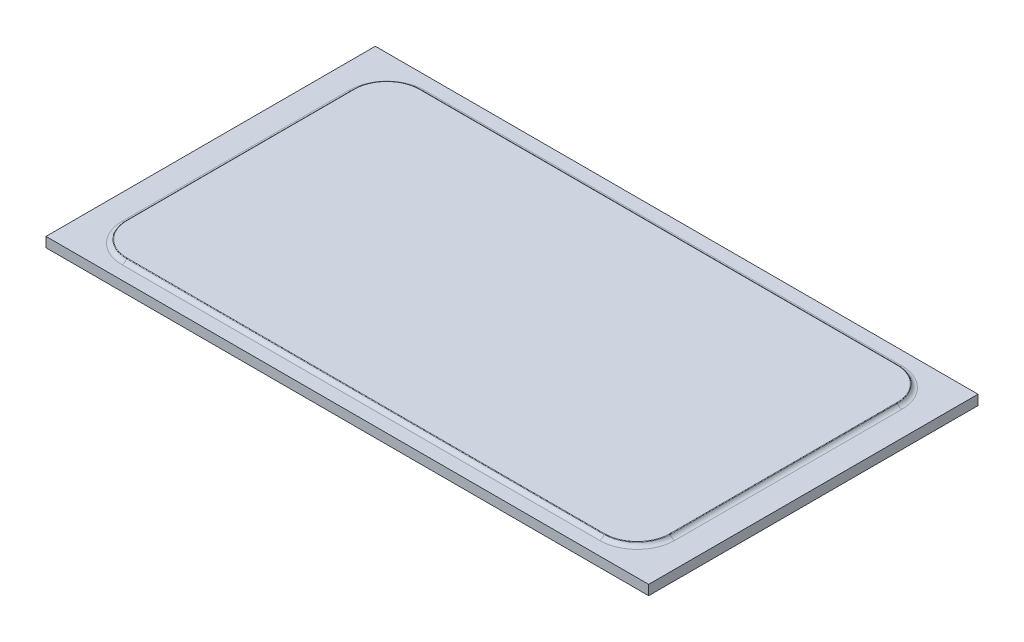
ISO-10303-21;
HEADER;
FILE_DESCRIPTION(('STEP AP214'),'2;1');
FILE_NAME('part.step','',(''),(''),'','','');
FILE_SCHEMA(('AUTOMOTIVE_DESIGN { 1 0 10303 214 1 1 1 1 }'));
ENDSEC;
DATA;
#1=APPLICATION_CONTEXT('core data for automotive mechanical design processes');
#2=APPLICATION_PROTOCOL_DEFINITION('international standard','automotive_design',2000,#1);
#3=PRODUCT_CONTEXT('',#1,'mechanical');
#4=PRODUCT('Part','Part','',(#3));
#5=PRODUCT_RELATED_PRODUCT_CATEGORY('part','',(#4));
#6=PRODUCT_DEFINITION_FORMATION('','',#4);
#7=PRODUCT_DEFINITION_CONTEXT('part definition',#1,'design');
#8=PRODUCT_DEFINITION('design','',#6,#7);
#9=PRODUCT_DEFINITION_SHAPE('','',#8);
#10=(LENGTH_UNIT() NAMED_UNIT(*) SI_UNIT(.MILLI.,.METRE.));
#11=(NAMED_UNIT(*) PLANE_ANGLE_UNIT() SI_UNIT($,.RADIAN.));
#12=(NAMED_UNIT(*) SI_UNIT($,.STERADIAN.) SOLID_ANGLE_UNIT());
#13=UNCERTAINTY_MEASURE_WITH_UNIT(LENGTH_MEASURE(1.E-05),#10,'distance_accuracy_value','');
#14=(GEOMETRIC_REPRESENTATION_CONTEXT(3) GLOBAL_UNCERTAINTY_ASSIGNED_CONTEXT((#13)) GLOBAL_UNIT_ASSIGNED_CONTEXT((#10,
#11,#12)) REPRESENTATION_CONTEXT('',''));
#15=CARTESIAN_POINT('',(0.,0.,0.));
#16=DIRECTION('',(0.,0.,1.));
#17=DIRECTION('',(1.,0.,0.));
#18=AXIS2_PLACEMENT_3D('',#15,#16,#17);
#19=CARTESIAN_POINT('',(0.,3.,0.));
#20=DIRECTION('',(0.,-1.,0.));
#21=DIRECTION('',(0.,0.,-1.));
#22=AXIS2_PLACEMENT_3D('',#19,#20,#21);
#23=PLANE('',#22);
#24=DIRECTION('',(-1.,0.,0.));
#25=VECTOR('',#24,1.);
#26=CARTESIAN_POINT('',(0.,3.,45.9142135623731));
#27=LINE('',#26,#25);
#28=CARTESIAN_POINT('',(72.5,3.,45.9142135623731));
#29=VERTEX_POINT('',#28);
#30=CARTESIAN_POINT('',(-72.5,3.,45.9142135623731));
#31=VERTEX_POINT('',#30);
#32=EDGE_CURVE('E178',#29,#31,#27,.T.);
#33=ORIENTED_EDGE('',*,*,#32,.T.);
#34=CARTESIAN_POINT('',(-72.5,3.,34.5));
#35=DIRECTION('',(0.,-1.,0.));
#36=DIRECTION('',(0.,0.,-1.));
#37=AXIS2_PLACEMENT_3D('',#34,#35,#36);
#38=CIRCLE('',#37,11.4142135623731);
#39=CARTESIAN_POINT('',(-83.9142135623731,3.,34.5));
#40=VERTEX_POINT('',#39);
#41=EDGE_CURVE('E200',#31,#40,#38,.T.);
#42=ORIENTED_EDGE('',*,*,#41,.T.);
#43=DIRECTION('',(0.,0.,-1.));
#44=VECTOR('',#43,1.);
#45=CARTESIAN_POINT('',(-83.9142135623731,3.,0.));
#46=LINE('',#45,#44);
#47=CARTESIAN_POINT('',(-83.9142135623731,3.,-34.5));
#48=VERTEX_POINT('',#47);
#49=EDGE_CURVE('E197',#40,#48,#46,.T.);
#50=ORIENTED_EDGE('',*,*,#49,.T.);
#51=CARTESIAN_POINT('',(-72.5,3.,-34.5));
#52=DIRECTION('',(0.,-1.,0.));
#53=DIRECTION('',(0.,0.,-1.));
#54=AXIS2_PLACEMENT_3D('',#51,#52,#53);
#55=CIRCLE('',#54,11.4142135623731);
#56=CARTESIAN_POINT('',(-72.5,3.,-45.9142135623731));
#57=VERTEX_POINT('',#56);
#58=EDGE_CURVE('E194',#48,#57,#55,.T.);
#59=ORIENTED_EDGE('',*,*,#58,.T.);
#60=DIRECTION('',(1.,0.,0.));
#61=VECTOR('',#60,1.);
#62=CARTESIAN_POINT('',(0.,3.,-45.9142135623731));
#63=LINE('',#62,#61);
#64=CARTESIAN_POINT('',(72.5,3.,-45.9142135623731));
#65=VERTEX_POINT('',#64);
#66=EDGE_CURVE('E191',#57,#65,#63,.T.);
#67=ORIENTED_EDGE('',*,*,#66,.T.);
#68=CARTESIAN_POINT('',(72.5,3.,-34.5));
#69=DIRECTION('',(0.,-1.,0.));
#70=DIRECTION('',(0.,0.,-1.));
#71=AXIS2_PLACEMENT_3D('',#68,#69,#70);
#72=CIRCLE('',#71,11.4142135623731);
#73=CARTESIAN_POINT('',(83.9142135623731,3.,-34.5));
#74=VERTEX_POINT('',#73);
#75=EDGE_CURVE('E189',#65,#74,#72,.T.);
#76=ORIENTED_EDGE('',*,*,#75,.T.);
#77=DIRECTION('',(0.,0.,1.));
#78=VECTOR('',#77,1.);
#79=CARTESIAN_POINT('',(83.9142135623731,3.,0.));
#80=LINE('',#79,#78);
#81=CARTESIAN_POINT('',(83.9142135623731,3.,34.5));
#82=VERTEX_POINT('',#81);
#83=EDGE_CURVE('E187',#74,#82,#80,.T.);
#84=ORIENTED_EDGE('',*,*,#83,.T.);
#85=CARTESIAN_POINT('',(72.5,3.,34.5));
#86=DIRECTION('',(0.,-1.,0.));
#87=DIRECTION('',(0.,0.,-1.));
#88=AXIS2_PLACEMENT_3D('',#85,#86,#87);
#89=CIRCLE('',#88,11.4142135623731);
#90=EDGE_CURVE('E180',#82,#29,#89,.T.);
#91=ORIENTED_EDGE('',*,*,#90,.T.);
#92=EDGE_LOOP('',(#33,#42,#50,#59,#67,#76,#84,#91));
#93=FACE_BOUND('',#92,.T.);
#94=DIRECTION('',(0.,0.,1.));
#95=VECTOR('',#94,1.);
#96=CARTESIAN_POINT('',(-91.5,3.,-50.));
#97=LINE('',#96,#95);
#98=CARTESIAN_POINT('',(-91.5,3.,-50.));
#99=VERTEX_POINT('',#98);
#100=CARTESIAN_POINT('',(-91.5,3.,50.));
#101=VERTEX_POINT('',#100);
#102=EDGE_CURVE('E165',#99,#101,#97,.T.);
#103=ORIENTED_EDGE('',*,*,#102,.T.);
#104=DIRECTION('',(1.,0.,0.));
#105=VECTOR('',#104,1.);
#106=CARTESIAN_POINT('',(91.5,3.,50.));
#107=LINE('',#106,#105);
#108=CARTESIAN_POINT('',(91.5,3.,50.));
#109=VERTEX_POINT('',#108);
#110=EDGE_CURVE('E154',#101,#109,#107,.T.);
#111=ORIENTED_EDGE('',*,*,#110,.T.);
#112=DIRECTION('',(0.,0.,-1.));
#113=VECTOR('',#112,1.);
#114=CARTESIAN_POINT('',(91.5,3.,-50.));
#115=LINE('',#114,#113);
#116=CARTESIAN_POINT('',(91.5,3.,-50.));
#117=VERTEX_POINT('',#116);
#118=EDGE_CURVE('E164',#109,#117,#115,.T.);
#119=ORIENTED_EDGE('',*,*,#118,.T.);
#120=DIRECTION('',(-1.,0.,0.));
#121=VECTOR('',#120,1.);
#122=CARTESIAN_POINT('',(91.5,3.,-50.));
#123=LINE('',#122,#121);
#124=EDGE_CURVE('E169',#117,#99,#123,.T.);
#125=ORIENTED_EDGE('',*,*,#124,.T.);
#126=EDGE_LOOP('',(#103,#111,#119,#125));
#127=FACE_BOUND('',#126,.T.);
#128=ADVANCED_FACE('F38',(#93,#127),#23,.F.);
#129=CARTESIAN_POINT('',(-91.5,3.,-50.));
#130=DIRECTION('',(1.,0.,0.));
#131=DIRECTION('',(0.,0.,-1.));
#132=AXIS2_PLACEMENT_3D('',#129,#130,#131);
#133=PLANE('',#132);
#134=DIRECTION('',(0.,0.,1.));
#135=VECTOR('',#134,1.);
#136=CARTESIAN_POINT('',(-91.5,0.,-50.));
#137=LINE('',#136,#135);
#138=CARTESIAN_POINT('',(-91.5,0.,-50.));
#139=VERTEX_POINT('',#138);
#140=CARTESIAN_POINT('',(-91.5,0.,50.));
#141=VERTEX_POINT('',#140);
#142=EDGE_CURVE('E177',#139,#141,#137,.T.);
#143=ORIENTED_EDGE('',*,*,#142,.T.);
#144=DIRECTION('',(0.,-1.,0.));
#145=VECTOR('',#144,1.);
#146=CARTESIAN_POINT('',(-91.5,3.,50.));
#147=LINE('',#146,#145);
#148=EDGE_CURVE('E158',#101,#141,#147,.T.);
#149=ORIENTED_EDGE('',*,*,#148,.F.);
#150=ORIENTED_EDGE('',*,*,#102,.F.);
#151=DIRECTION('',(0.,-1.,0.));
#152=VECTOR('',#151,1.);
#153=CARTESIAN_POINT('',(-91.5,3.,-50.));
#154=LINE('',#153,#152);
#155=EDGE_CURVE('E577',#99,#139,#154,.T.);
#156=ORIENTED_EDGE('',*,*,#155,.T.);
#157=EDGE_LOOP('',(#143,#149,#150,#156));
#158=FACE_BOUND('',#157,.T.);
#159=ADVANCED_FACE('F175',(#158),#133,.F.);
#160=CARTESIAN_POINT('',(91.5,3.,50.));
#161=DIRECTION('',(0.,0.,-1.));
#162=DIRECTION('',(-1.,0.,0.));
#163=AXIS2_PLACEMENT_3D('',#160,#161,#162);
#164=PLANE('',#163);
#165=DIRECTION('',(1.,0.,0.));
#166=VECTOR('',#165,1.);
#167=CARTESIAN_POINT('',(91.5,0.,50.));
#168=LINE('',#167,#166);
#169=CARTESIAN_POINT('',(91.5,0.,50.));
#170=VERTEX_POINT('',#169);
#171=EDGE_CURVE('E575',#141,#170,#168,.T.);
#172=ORIENTED_EDGE('',*,*,#171,.T.);
#173=DIRECTION('',(0.,-1.,0.));
#174=VECTOR('',#173,1.);
#175=CARTESIAN_POINT('',(91.5,3.,50.));
#176=LINE('',#175,#174);
#177=EDGE_CURVE('E161',#109,#170,#176,.T.);
#178=ORIENTED_EDGE('',*,*,#177,.F.);
#179=ORIENTED_EDGE('',*,*,#110,.F.);
#180=ORIENTED_EDGE('',*,*,#148,.T.);
#181=EDGE_LOOP('',(#172,#178,#179,#180));
#182=FACE_BOUND('',#181,.T.);
#183=ADVANCED_FACE('F156',(#182),#164,.F.);
#184=CARTESIAN_POINT('',(91.5,3.,-50.));
#185=DIRECTION('',(-1.,0.,0.));
#186=DIRECTION('',(0.,0.,1.));
#187=AXIS2_PLACEMENT_3D('',#184,#185,#186);
#188=PLANE('',#187);
#189=DIRECTION('',(0.,0.,-1.));
#190=VECTOR('',#189,1.);
#191=CARTESIAN_POINT('',(91.5,0.,-50.));
#192=LINE('',#191,#190);
#193=CARTESIAN_POINT('',(91.5,0.,-50.));
#194=VERTEX_POINT('',#193);
#195=EDGE_CURVE('E572',#170,#194,#192,.T.);
#196=ORIENTED_EDGE('',*,*,#195,.T.);
#197=DIRECTION('',(0.,-1.,0.));
#198=VECTOR('',#197,1.);
#199=CARTESIAN_POINT('',(91.5,3.,-50.));
#200=LINE('',#199,#198);
#201=EDGE_CURVE('E182',#117,#194,#200,.T.);
#202=ORIENTED_EDGE('',*,*,#201,.F.);
#203=ORIENTED_EDGE('',*,*,#118,.F.);
#204=ORIENTED_EDGE('',*,*,#177,.T.);
#205=EDGE_LOOP('',(#196,#202,#203,#204));
#206=FACE_BOUND('',#205,.T.);
#207=ADVANCED_FACE('F354',(#206),#188,.F.);
#208=CARTESIAN_POINT('',(91.5,3.,-50.));
#209=DIRECTION('',(0.,0.,1.));
#210=DIRECTION('',(1.,0.,0.));
#211=AXIS2_PLACEMENT_3D('',#208,#209,#210);
#212=PLANE('',#211);
#213=DIRECTION('',(-1.,0.,0.));
#214=VECTOR('',#213,1.);
#215=CARTESIAN_POINT('',(91.5,0.,-50.));
#216=LINE('',#215,#214);
#217=EDGE_CURVE('E173',#194,#139,#216,.T.);
#218=ORIENTED_EDGE('',*,*,#217,.T.);
#219=ORIENTED_EDGE('',*,*,#155,.F.);
#220=ORIENTED_EDGE('',*,*,#124,.F.);
#221=ORIENTED_EDGE('',*,*,#201,.T.);
#222=EDGE_LOOP('',(#218,#219,#220,#221));
#223=FACE_BOUND('',#222,.T.);
#224=ADVANCED_FACE('F350',(#223),#212,.F.);
#225=CARTESIAN_POINT('',(0.,0.,0.));
#226=DIRECTION('',(0.,-1.,0.));
#227=DIRECTION('',(0.,0.,-1.));
#228=AXIS2_PLACEMENT_3D('',#225,#226,#227);
#229=PLANE('',#228);
#230=ORIENTED_EDGE('',*,*,#142,.F.);
#231=ORIENTED_EDGE('',*,*,#217,.F.);
#232=ORIENTED_EDGE('',*,*,#195,.F.);
#233=ORIENTED_EDGE('',*,*,#171,.F.);
#234=EDGE_LOOP('',(#230,#231,#232,#233));
#235=FACE_BOUND('',#234,.T.);
#236=ADVANCED_FACE('F347',(#235),#229,.T.);
#237=CARTESIAN_POINT('',(0.,4.,0.));
#238=DIRECTION('',(0.,-1.,0.));
#239=DIRECTION('',(0.,0.,-1.));
#240=AXIS2_PLACEMENT_3D('',#237,#238,#239);
#241=PLANE('',#240);
#242=DIRECTION('',(0.,0.,-1.));
#243=VECTOR('',#242,1.);
#244=CARTESIAN_POINT('',(-82.3650202238901,4.,0.));
#245=LINE('',#244,#243);
#246=CARTESIAN_POINT('',(-82.3650202238901,4.,-34.5));
#247=VERTEX_POINT('',#246);
#248=CARTESIAN_POINT('',(-82.3650202238901,4.,34.5));
#249=VERTEX_POINT('',#248);
#250=EDGE_CURVE('E232',#247,#249,#245,.F.);
#251=ORIENTED_EDGE('',*,*,#250,.T.);
#252=CARTESIAN_POINT('',(-72.5,4.,34.5));
#253=DIRECTION('',(0.,-1.,0.));
#254=DIRECTION('',(0.,0.,-1.));
#255=AXIS2_PLACEMENT_3D('',#252,#253,#254);
#256=CIRCLE('',#255,9.86502022389013);
#257=CARTESIAN_POINT('',(-72.5,4.,44.3650202238901));
#258=VERTEX_POINT('',#257);
#259=EDGE_CURVE('E234',#249,#258,#256,.F.);
#260=ORIENTED_EDGE('',*,*,#259,.T.);
#261=DIRECTION('',(-1.,0.,0.));
#262=VECTOR('',#261,1.);
#263=CARTESIAN_POINT('',(0.,4.,44.3650202238901));
#264=LINE('',#263,#262);
#265=CARTESIAN_POINT('',(72.5,4.,44.3650202238901));
#266=VERTEX_POINT('',#265);
#267=EDGE_CURVE('E203',#258,#266,#264,.F.);
#268=ORIENTED_EDGE('',*,*,#267,.T.);
#269=CARTESIAN_POINT('',(72.5,4.,34.5));
#270=DIRECTION('',(0.,-1.,0.));
#271=DIRECTION('',(0.,0.,-1.));
#272=AXIS2_PLACEMENT_3D('',#269,#270,#271);
#273=CIRCLE('',#272,9.86502022389013);
#274=CARTESIAN_POINT('',(82.3650202238901,4.,34.5));
#275=VERTEX_POINT('',#274);
#276=EDGE_CURVE('E222',#266,#275,#273,.F.);
#277=ORIENTED_EDGE('',*,*,#276,.T.);
#278=DIRECTION('',(0.,0.,1.));
#279=VECTOR('',#278,1.);
#280=CARTESIAN_POINT('',(82.3650202238901,4.,0.));
#281=LINE('',#280,#279);
#282=CARTESIAN_POINT('',(82.3650202238901,4.,-34.5));
#283=VERTEX_POINT('',#282);
#284=EDGE_CURVE('E224',#275,#283,#281,.F.);
#285=ORIENTED_EDGE('',*,*,#284,.T.);
#286=CARTESIAN_POINT('',(72.5,4.,-34.5));
#287=DIRECTION('',(0.,-1.,0.));
#288=DIRECTION('',(0.,0.,-1.));
#289=AXIS2_PLACEMENT_3D('',#286,#287,#288);
#290=CIRCLE('',#289,9.86502022389013);
#291=CARTESIAN_POINT('',(72.5,4.,-44.3650202238902));
#292=VERTEX_POINT('',#291);
#293=EDGE_CURVE('E226',#283,#292,#290,.F.);
#294=ORIENTED_EDGE('',*,*,#293,.T.);
#295=DIRECTION('',(1.,0.,0.));
#296=VECTOR('',#295,1.);
#297=CARTESIAN_POINT('',(0.,4.,-44.3650202238901));
#298=LINE('',#297,#296);
#299=CARTESIAN_POINT('',(-72.5,4.,-44.3650202238901));
#300=VERTEX_POINT('',#299);
#301=EDGE_CURVE('E228',#292,#300,#298,.F.);
#302=ORIENTED_EDGE('',*,*,#301,.T.);
#303=CARTESIAN_POINT('',(-72.5,4.,-34.5));
#304=DIRECTION('',(0.,-1.,0.));
#305=DIRECTION('',(0.,0.,-1.));
#306=AXIS2_PLACEMENT_3D('',#303,#304,#305);
#307=CIRCLE('',#306,9.86502022389013);
#308=EDGE_CURVE('E230',#300,#247,#307,.F.);
#309=ORIENTED_EDGE('',*,*,#308,.T.);
#310=EDGE_LOOP('',(#251,#260,#268,#277,#285,#294,#302,#309));
#311=FACE_BOUND('',#310,.T.);
#312=ADVANCED_FACE('F309',(#311),#241,.F.);
#313=CARTESIAN_POINT('',(72.5,4.5,-34.5));
#314=DIRECTION('',(0.,-1.,0.));
#315=DIRECTION('',(0.,0.,-1.));
#316=AXIS2_PLACEMENT_3D('',#313,#314,#315);
#317=TOROIDAL_SURFACE('',#316,11.4142135623731,1.5);
#318=CARTESIAN_POINT('',(72.5,4.5,-45.9142135623731));
#319=DIRECTION('',(1.,0.,0.));
#320=DIRECTION('',(0.,0.,-1.));
#321=AXIS2_PLACEMENT_3D('',#318,#319,#320);
#322=CIRCLE('',#321,1.5);
#323=CARTESIAN_POINT('',(72.5,3.88235294117647,-44.5472782637117));
#324=VERTEX_POINT('',#323);
#325=EDGE_CURVE('E217',#324,#65,#322,.T.);
#326=ORIENTED_EDGE('',*,*,#325,.F.);
#327=CARTESIAN_POINT('',(72.5,3.88235294117647,-34.5));
#328=DIRECTION('',(0.,1.,0.));
#329=DIRECTION('',(0.,0.,1.));
#330=AXIS2_PLACEMENT_3D('',#327,#328,#329);
#331=CIRCLE('',#330,10.0472782637116);
#332=CARTESIAN_POINT('',(82.5472782637116,3.88235294117648,-34.5));
#333=VERTEX_POINT('',#332);
#334=EDGE_CURVE('E246',#324,#333,#331,.F.);
#335=ORIENTED_EDGE('',*,*,#334,.T.);
#336=CARTESIAN_POINT('',(83.9142135623731,4.5,-34.5));
#337=DIRECTION('',(0.,0.,-1.));
#338=DIRECTION('',(-1.,0.,0.));
#339=AXIS2_PLACEMENT_3D('',#336,#337,#338);
#340=CIRCLE('',#339,1.5);
#341=EDGE_CURVE('E219',#74,#333,#340,.T.);
#342=ORIENTED_EDGE('',*,*,#341,.F.);
#343=ORIENTED_EDGE('',*,*,#75,.F.);
#344=EDGE_LOOP('',(#326,#335,#342,#343));
#345=FACE_BOUND('',#344,.T.);
#346=ADVANCED_FACE('F283',(#345),#317,.F.);
#347=CARTESIAN_POINT('',(83.9142135623731,4.5,-44.5));
#348=DIRECTION('',(0.,0.,1.));
#349=DIRECTION('',(1.,0.,0.));
#350=AXIS2_PLACEMENT_3D('',#347,#348,#349);
#351=CYLINDRICAL_SURFACE('',#350,1.5);
#352=ORIENTED_EDGE('',*,*,#341,.T.);
#353=DIRECTION('',(0.,0.,1.));
#354=VECTOR('',#353,1.);
#355=CARTESIAN_POINT('',(82.5472782637116,3.88235294117647,-44.5));
#356=LINE('',#355,#354);
#357=CARTESIAN_POINT('',(82.5472782637116,3.88235294117647,34.5));
#358=VERTEX_POINT('',#357);
#359=EDGE_CURVE('E62',#333,#358,#356,.T.);
#360=ORIENTED_EDGE('',*,*,#359,.T.);
#361=CARTESIAN_POINT('',(83.9142135623731,4.5,34.5));
#362=DIRECTION('',(0.,0.,-1.));
#363=DIRECTION('',(-1.,0.,0.));
#364=AXIS2_PLACEMENT_3D('',#361,#362,#363);
#365=CIRCLE('',#364,1.5);
#366=EDGE_CURVE('E215',#82,#358,#365,.T.);
#367=ORIENTED_EDGE('',*,*,#366,.F.);
#368=ORIENTED_EDGE('',*,*,#83,.F.);
#369=EDGE_LOOP('',(#352,#360,#367,#368));
#370=FACE_BOUND('',#369,.T.);
#371=ADVANCED_FACE('F286',(#370),#351,.F.);
#372=CARTESIAN_POINT('',(82.5,4.5,-45.9142135623731));
#373=DIRECTION('',(1.,0.,0.));
#374=DIRECTION('',(0.,0.,-1.));
#375=AXIS2_PLACEMENT_3D('',#372,#373,#374);
#376=CYLINDRICAL_SURFACE('',#375,1.5);
#377=CARTESIAN_POINT('',(-72.5,4.5,-45.9142135623731));
#378=DIRECTION('',(1.,0.,0.));
#379=DIRECTION('',(0.,0.,-1.));
#380=AXIS2_PLACEMENT_3D('',#377,#378,#379);
#381=CIRCLE('',#380,1.5);
#382=CARTESIAN_POINT('',(-72.5,3.88235294117647,-44.5472782637117));
#383=VERTEX_POINT('',#382);
#384=EDGE_CURVE('E213',#383,#57,#381,.T.);
#385=ORIENTED_EDGE('',*,*,#384,.F.);
#386=DIRECTION('',(1.,0.,0.));
#387=VECTOR('',#386,1.);
#388=CARTESIAN_POINT('',(82.5,3.88235294117647,-44.5472782637117));
#389=LINE('',#388,#387);
#390=EDGE_CURVE('E244',#383,#324,#389,.T.);
#391=ORIENTED_EDGE('',*,*,#390,.T.);
#392=ORIENTED_EDGE('',*,*,#325,.T.);
#393=ORIENTED_EDGE('',*,*,#66,.F.);
#394=EDGE_LOOP('',(#385,#391,#392,#393));
#395=FACE_BOUND('',#394,.T.);
#396=ADVANCED_FACE('F293',(#395),#376,.F.);
#397=CARTESIAN_POINT('',(72.5,4.5,34.5));
#398=DIRECTION('',(0.,-1.,0.));
#399=DIRECTION('',(0.,0.,-1.));
#400=AXIS2_PLACEMENT_3D('',#397,#398,#399);
#401=TOROIDAL_SURFACE('',#400,11.4142135623731,1.5);
#402=ORIENTED_EDGE('',*,*,#366,.T.);
#403=CARTESIAN_POINT('',(72.5,3.88235294117647,34.5));
#404=DIRECTION('',(0.,1.,0.));
#405=DIRECTION('',(0.,0.,1.));
#406=AXIS2_PLACEMENT_3D('',#403,#404,#405);
#407=CIRCLE('',#406,10.0472782637116);
#408=CARTESIAN_POINT('',(72.5,3.88235294117647,44.5472782637116));
#409=VERTEX_POINT('',#408);
#410=EDGE_CURVE('E47',#358,#409,#407,.F.);
#411=ORIENTED_EDGE('',*,*,#410,.T.);
#412=CARTESIAN_POINT('',(72.5,4.5,45.9142135623731));
#413=DIRECTION('',(1.,0.,0.));
#414=DIRECTION('',(0.,0.,-1.));
#415=AXIS2_PLACEMENT_3D('',#412,#413,#414);
#416=CIRCLE('',#415,1.5);
#417=EDGE_CURVE('E211',#29,#409,#416,.T.);
#418=ORIENTED_EDGE('',*,*,#417,.F.);
#419=ORIENTED_EDGE('',*,*,#90,.F.);
#420=EDGE_LOOP('',(#402,#411,#418,#419));
#421=FACE_BOUND('',#420,.T.);
#422=ADVANCED_FACE('F371',(#421),#401,.F.);
#423=CARTESIAN_POINT('',(-72.5,4.5,-34.5));
#424=DIRECTION('',(0.,-1.,0.));
#425=DIRECTION('',(0.,0.,-1.));
#426=AXIS2_PLACEMENT_3D('',#423,#424,#425);
#427=TOROIDAL_SURFACE('',#426,11.4142135623731,1.5);
#428=CARTESIAN_POINT('',(-83.9142135623731,4.5,-34.5));
#429=DIRECTION('',(0.,0.,-1.));
#430=DIRECTION('',(-1.,0.,0.));
#431=AXIS2_PLACEMENT_3D('',#428,#429,#430);
#432=CIRCLE('',#431,1.5);
#433=CARTESIAN_POINT('',(-82.5472782637116,3.88235294117647,-34.5));
#434=VERTEX_POINT('',#433);
#435=EDGE_CURVE('E209',#434,#48,#432,.T.);
#436=ORIENTED_EDGE('',*,*,#435,.F.);
#437=CARTESIAN_POINT('',(-72.5,3.88235294117647,-34.5));
#438=DIRECTION('',(0.,1.,0.));
#439=DIRECTION('',(0.,0.,1.));
#440=AXIS2_PLACEMENT_3D('',#437,#438,#439);
#441=CIRCLE('',#440,10.0472782637116);
#442=EDGE_CURVE('E242',#434,#383,#441,.F.);
#443=ORIENTED_EDGE('',*,*,#442,.T.);
#444=ORIENTED_EDGE('',*,*,#384,.T.);
#445=ORIENTED_EDGE('',*,*,#58,.F.);
#446=EDGE_LOOP('',(#436,#443,#444,#445));
#447=FACE_BOUND('',#446,.T.);
#448=ADVANCED_FACE('F296',(#447),#427,.F.);
#449=CARTESIAN_POINT('',(82.5,4.5,45.9142135623731));
#450=DIRECTION('',(-1.,0.,0.));
#451=DIRECTION('',(0.,0.,1.));
#452=AXIS2_PLACEMENT_3D('',#449,#450,#451);
#453=CYLINDRICAL_SURFACE('',#452,1.5);
#454=ORIENTED_EDGE('',*,*,#417,.T.);
#455=DIRECTION('',(-1.,0.,0.));
#456=VECTOR('',#455,1.);
#457=CARTESIAN_POINT('',(82.5,3.88235294117647,44.5472782637116));
#458=LINE('',#457,#456);
#459=CARTESIAN_POINT('',(-72.5,3.88235294117647,44.5472782637116));
#460=VERTEX_POINT('',#459);
#461=EDGE_CURVE('E12',#409,#460,#458,.T.);
#462=ORIENTED_EDGE('',*,*,#461,.T.);
#463=CARTESIAN_POINT('',(-72.5,4.5,45.9142135623731));
#464=DIRECTION('',(1.,0.,0.));
#465=DIRECTION('',(0.,0.,-1.));
#466=AXIS2_PLACEMENT_3D('',#463,#464,#465);
#467=CIRCLE('',#466,1.5);
#468=EDGE_CURVE('E206',#31,#460,#467,.T.);
#469=ORIENTED_EDGE('',*,*,#468,.F.);
#470=ORIENTED_EDGE('',*,*,#32,.F.);
#471=EDGE_LOOP('',(#454,#462,#469,#470));
#472=FACE_BOUND('',#471,.T.);
#473=ADVANCED_FACE('F323',(#472),#453,.F.);
#474=CARTESIAN_POINT('',(-83.9142135623731,4.5,-44.5));
#475=DIRECTION('',(0.,0.,-1.));
#476=DIRECTION('',(-1.,0.,0.));
#477=AXIS2_PLACEMENT_3D('',#474,#475,#476);
#478=CYLINDRICAL_SURFACE('',#477,1.5);
#479=CARTESIAN_POINT('',(-83.9142135623731,4.5,34.5));
#480=DIRECTION('',(0.,0.,-1.));
#481=DIRECTION('',(-1.,0.,0.));
#482=AXIS2_PLACEMENT_3D('',#479,#480,#481);
#483=CIRCLE('',#482,1.5);
#484=CARTESIAN_POINT('',(-82.5472782637116,3.88235294117647,34.5));
#485=VERTEX_POINT('',#484);
#486=EDGE_CURVE('E204',#485,#40,#483,.T.);
#487=ORIENTED_EDGE('',*,*,#486,.F.);
#488=DIRECTION('',(0.,0.,-1.));
#489=VECTOR('',#488,1.);
#490=CARTESIAN_POINT('',(-82.5472782637116,3.88235294117647,-44.5));
#491=LINE('',#490,#489);
#492=EDGE_CURVE('E240',#485,#434,#491,.T.);
#493=ORIENTED_EDGE('',*,*,#492,.T.);
#494=ORIENTED_EDGE('',*,*,#435,.T.);
#495=ORIENTED_EDGE('',*,*,#49,.F.);
#496=EDGE_LOOP('',(#487,#493,#494,#495));
#497=FACE_BOUND('',#496,.T.);
#498=ADVANCED_FACE('F363',(#497),#478,.F.);
#499=CARTESIAN_POINT('',(-72.5,4.5,34.5));
#500=DIRECTION('',(0.,-1.,0.));
#501=DIRECTION('',(0.,0.,-1.));
#502=AXIS2_PLACEMENT_3D('',#499,#500,#501);
#503=TOROIDAL_SURFACE('',#502,11.4142135623731,1.5);
#504=ORIENTED_EDGE('',*,*,#468,.T.);
#505=CARTESIAN_POINT('',(-72.5,3.88235294117647,34.5));
#506=DIRECTION('',(0.,1.,0.));
#507=DIRECTION('',(0.,0.,1.));
#508=AXIS2_PLACEMENT_3D('',#505,#506,#507);
#509=CIRCLE('',#508,10.0472782637116);
#510=EDGE_CURVE('E237',#460,#485,#509,.F.);
#511=ORIENTED_EDGE('',*,*,#510,.T.);
#512=ORIENTED_EDGE('',*,*,#486,.T.);
#513=ORIENTED_EDGE('',*,*,#41,.F.);
#514=EDGE_LOOP('',(#504,#511,#512,#513));
#515=FACE_BOUND('',#514,.T.);
#516=ADVANCED_FACE('F328',(#515),#503,.F.);
#517=CARTESIAN_POINT('',(72.5,3.8,-34.5));
#518=DIRECTION('',(0.,1.,0.));
#519=DIRECTION('',(0.,0.,1.));
#520=AXIS2_PLACEMENT_3D('',#517,#518,#519);
#521=TOROIDAL_SURFACE('',#520,9.86502022389013,0.2);
#522=CARTESIAN_POINT('',(82.3650202238901,3.8,-34.5));
#523=DIRECTION('',(0.,0.,1.));
#524=DIRECTION('',(1.,0.,0.));
#525=AXIS2_PLACEMENT_3D('',#522,#523,#524);
#526=CIRCLE('',#525,0.2);
#527=EDGE_CURVE('E265',#333,#283,#526,.T.);
#528=ORIENTED_EDGE('',*,*,#527,.F.);
#529=ORIENTED_EDGE('',*,*,#334,.F.);
#530=CARTESIAN_POINT('',(72.5,3.8,-44.3650202238902));
#531=DIRECTION('',(-1.,0.,0.));
#532=DIRECTION('',(0.,0.,1.));
#533=AXIS2_PLACEMENT_3D('',#530,#531,#532);
#534=CIRCLE('',#533,0.2);
#535=EDGE_CURVE('E42',#292,#324,#534,.T.);
#536=ORIENTED_EDGE('',*,*,#535,.F.);
#537=ORIENTED_EDGE('',*,*,#293,.F.);
#538=EDGE_LOOP('',(#528,#529,#536,#537));
#539=FACE_BOUND('',#538,.T.);
#540=ADVANCED_FACE('F40',(#539),#521,.T.);
#541=CARTESIAN_POINT('',(82.5,3.8,-44.3650202238902));
#542=DIRECTION('',(1.,0.,0.));
#543=DIRECTION('',(0.,0.,-1.));
#544=AXIS2_PLACEMENT_3D('',#541,#542,#543);
#545=CYLINDRICAL_SURFACE('',#544,0.2);
#546=ORIENTED_EDGE('',*,*,#535,.T.);
#547=ORIENTED_EDGE('',*,*,#390,.F.);
#548=CARTESIAN_POINT('',(-72.5,3.8,-44.3650202238901));
#549=DIRECTION('',(-1.,0.,0.));
#550=DIRECTION('',(0.,0.,1.));
#551=AXIS2_PLACEMENT_3D('',#548,#549,#550);
#552=CIRCLE('',#551,0.2);
#553=EDGE_CURVE('E263',#300,#383,#552,.T.);
#554=ORIENTED_EDGE('',*,*,#553,.F.);
#555=ORIENTED_EDGE('',*,*,#301,.F.);
#556=EDGE_LOOP('',(#546,#547,#554,#555));
#557=FACE_BOUND('',#556,.T.);
#558=ADVANCED_FACE('F275',(#557),#545,.T.);
#559=CARTESIAN_POINT('',(82.3650202238901,3.8,-44.5));
#560=DIRECTION('',(0.,0.,1.));
#561=DIRECTION('',(1.,0.,0.));
#562=AXIS2_PLACEMENT_3D('',#559,#560,#561);
#563=CYLINDRICAL_SURFACE('',#562,0.2);
#564=ORIENTED_EDGE('',*,*,#527,.T.);
#565=ORIENTED_EDGE('',*,*,#284,.F.);
#566=CARTESIAN_POINT('',(82.3650202238901,3.8,34.5));
#567=DIRECTION('',(0.,0.,1.));
#568=DIRECTION('',(1.,0.,0.));
#569=AXIS2_PLACEMENT_3D('',#566,#567,#568);
#570=CIRCLE('',#569,0.2);
#571=EDGE_CURVE('E260',#358,#275,#570,.T.);
#572=ORIENTED_EDGE('',*,*,#571,.F.);
#573=ORIENTED_EDGE('',*,*,#359,.F.);
#574=EDGE_LOOP('',(#564,#565,#572,#573));
#575=FACE_BOUND('',#574,.T.);
#576=ADVANCED_FACE('F312',(#575),#563,.T.);
#577=CARTESIAN_POINT('',(-72.5,3.8,-34.5));
#578=DIRECTION('',(0.,1.,0.));
#579=DIRECTION('',(0.,0.,1.));
#580=AXIS2_PLACEMENT_3D('',#577,#578,#579);
#581=TOROIDAL_SURFACE('',#580,9.86502022389013,0.2);
#582=ORIENTED_EDGE('',*,*,#553,.T.);
#583=ORIENTED_EDGE('',*,*,#442,.F.);
#584=CARTESIAN_POINT('',(-82.3650202238901,3.8,-34.5));
#585=DIRECTION('',(0.,0.,1.));
#586=DIRECTION('',(1.,0.,0.));
#587=AXIS2_PLACEMENT_3D('',#584,#585,#586);
#588=CIRCLE('',#587,0.2);
#589=EDGE_CURVE('E257',#247,#434,#588,.T.);
#590=ORIENTED_EDGE('',*,*,#589,.F.);
#591=ORIENTED_EDGE('',*,*,#308,.F.);
#592=EDGE_LOOP('',(#582,#583,#590,#591));
#593=FACE_BOUND('',#592,.T.);
#594=ADVANCED_FACE('F300',(#593),#581,.T.);
#595=CARTESIAN_POINT('',(72.5,3.8,34.5));
#596=DIRECTION('',(0.,1.,0.));
#597=DIRECTION('',(0.,0.,1.));
#598=AXIS2_PLACEMENT_3D('',#595,#596,#597);
#599=TOROIDAL_SURFACE('',#598,9.86502022389013,0.2);
#600=ORIENTED_EDGE('',*,*,#571,.T.);
#601=ORIENTED_EDGE('',*,*,#276,.F.);
#602=CARTESIAN_POINT('',(72.5,3.8,44.3650202238901));
#603=DIRECTION('',(-1.,0.,0.));
#604=DIRECTION('',(0.,0.,1.));
#605=AXIS2_PLACEMENT_3D('',#602,#603,#604);
#606=CIRCLE('',#605,0.2);
#607=EDGE_CURVE('E254',#409,#266,#606,.T.);
#608=ORIENTED_EDGE('',*,*,#607,.F.);
#609=ORIENTED_EDGE('',*,*,#410,.F.);
#610=EDGE_LOOP('',(#600,#601,#608,#609));
#611=FACE_BOUND('',#610,.T.);
#612=ADVANCED_FACE('F314',(#611),#599,.T.);
#613=CARTESIAN_POINT('',(-82.3650202238901,3.8,-44.5));
#614=DIRECTION('',(0.,0.,-1.));
#615=DIRECTION('',(-1.,0.,0.));
#616=AXIS2_PLACEMENT_3D('',#613,#614,#615);
#617=CYLINDRICAL_SURFACE('',#616,0.2);
#618=ORIENTED_EDGE('',*,*,#589,.T.);
#619=ORIENTED_EDGE('',*,*,#492,.F.);
#620=CARTESIAN_POINT('',(-82.3650202238901,3.8,34.5));
#621=DIRECTION('',(0.,0.,1.));
#622=DIRECTION('',(1.,0.,0.));
#623=AXIS2_PLACEMENT_3D('',#620,#621,#622);
#624=CIRCLE('',#623,0.2);
#625=EDGE_CURVE('E252',#249,#485,#624,.T.);
#626=ORIENTED_EDGE('',*,*,#625,.F.);
#627=ORIENTED_EDGE('',*,*,#250,.F.);
#628=EDGE_LOOP('',(#618,#619,#626,#627));
#629=FACE_BOUND('',#628,.T.);
#630=ADVANCED_FACE('F305',(#629),#617,.T.);
#631=CARTESIAN_POINT('',(82.5,3.8,44.3650202238901));
#632=DIRECTION('',(-1.,0.,0.));
#633=DIRECTION('',(0.,0.,1.));
#634=AXIS2_PLACEMENT_3D('',#631,#632,#633);
#635=CYLINDRICAL_SURFACE('',#634,0.2);
#636=ORIENTED_EDGE('',*,*,#607,.T.);
#637=ORIENTED_EDGE('',*,*,#267,.F.);
#638=CARTESIAN_POINT('',(-72.5,3.8,44.3650202238901));
#639=DIRECTION('',(-1.,0.,0.));
#640=DIRECTION('',(0.,0.,1.));
#641=AXIS2_PLACEMENT_3D('',#638,#639,#640);
#642=CIRCLE('',#641,0.2);
#643=EDGE_CURVE('E250',#460,#258,#642,.T.);
#644=ORIENTED_EDGE('',*,*,#643,.F.);
#645=ORIENTED_EDGE('',*,*,#461,.F.);
#646=EDGE_LOOP('',(#636,#637,#644,#645));
#647=FACE_BOUND('',#646,.T.);
#648=ADVANCED_FACE('F320',(#647),#635,.T.);
#649=CARTESIAN_POINT('',(-72.5,3.8,34.5));
#650=DIRECTION('',(0.,1.,0.));
#651=DIRECTION('',(0.,0.,1.));
#652=AXIS2_PLACEMENT_3D('',#649,#650,#651);
#653=TOROIDAL_SURFACE('',#652,9.86502022389013,0.2);
#654=ORIENTED_EDGE('',*,*,#625,.T.);
#655=ORIENTED_EDGE('',*,*,#510,.F.);
#656=ORIENTED_EDGE('',*,*,#643,.T.);
#657=ORIENTED_EDGE('',*,*,#259,.F.);
#658=EDGE_LOOP('',(#654,#655,#656,#657));
#659=FACE_BOUND('',#658,.T.);
#660=ADVANCED_FACE('F331',(#659),#653,.T.);
#661=CLOSED_SHELL('',(#128,#159,#183,#207,#224,#236,#312,#346,#371,#396,#422,#448,#473,#498,
#516,#540,#558,#576,#594,#612,#630,#648,#660));
#662=MANIFOLD_SOLID_BREP('B2',#661);
#663=ADVANCED_BREP_SHAPE_REPRESENTATION('',(#18,#662),#14);
#664=SHAPE_DEFINITION_REPRESENTATION(#9,#663);
ENDSEC;
END-ISO-10303-21;
